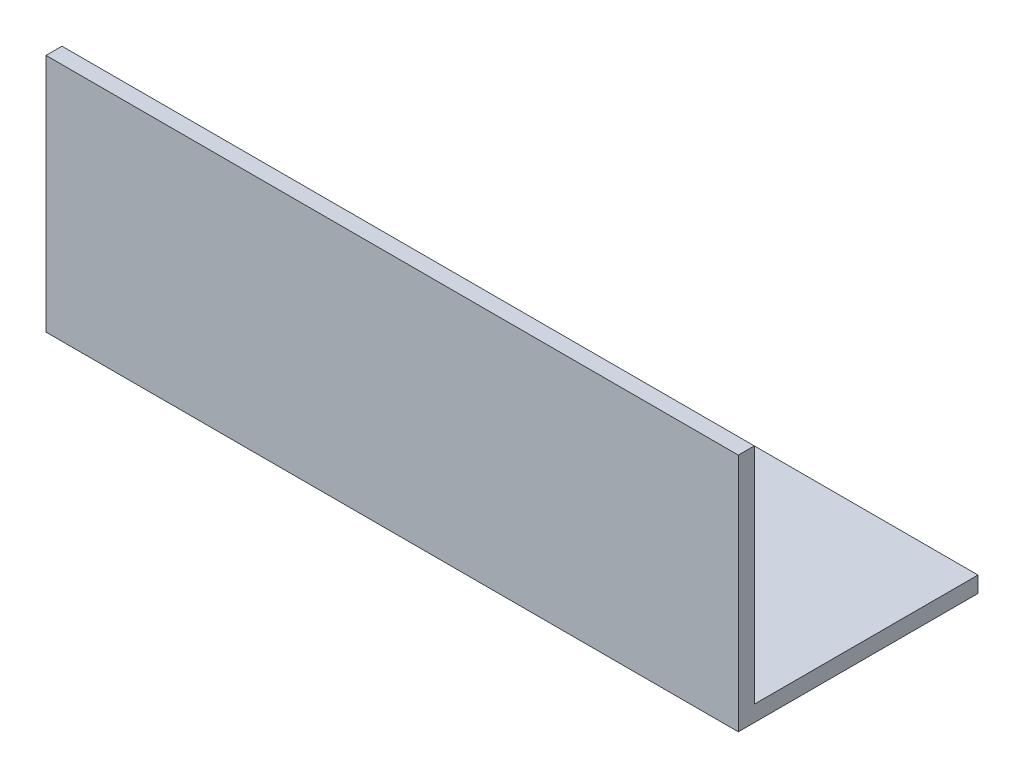
ISO-10303-21;
HEADER;
FILE_DESCRIPTION(('STEP AP214'),'2;1');
FILE_NAME('part.step','',(''),(''),'','','');
FILE_SCHEMA(('AUTOMOTIVE_DESIGN { 1 0 10303 214 1 1 1 1 }'));
ENDSEC;
DATA;
#1=APPLICATION_CONTEXT('core data for automotive mechanical design processes');
#2=APPLICATION_PROTOCOL_DEFINITION('international standard','automotive_design',2000,#1);
#3=PRODUCT_CONTEXT('',#1,'mechanical');
#4=PRODUCT('Part','Part','',(#3));
#5=PRODUCT_RELATED_PRODUCT_CATEGORY('part','',(#4));
#6=PRODUCT_DEFINITION_FORMATION('','',#4);
#7=PRODUCT_DEFINITION_CONTEXT('part definition',#1,'design');
#8=PRODUCT_DEFINITION('design','',#6,#7);
#9=PRODUCT_DEFINITION_SHAPE('','',#8);
#10=(LENGTH_UNIT() NAMED_UNIT(*) SI_UNIT(.MILLI.,.METRE.));
#11=(NAMED_UNIT(*) PLANE_ANGLE_UNIT() SI_UNIT($,.RADIAN.));
#12=(NAMED_UNIT(*) SI_UNIT($,.STERADIAN.) SOLID_ANGLE_UNIT());
#13=UNCERTAINTY_MEASURE_WITH_UNIT(LENGTH_MEASURE(1.E-05),#10,'distance_accuracy_value','');
#14=(GEOMETRIC_REPRESENTATION_CONTEXT(3) GLOBAL_UNCERTAINTY_ASSIGNED_CONTEXT((#13)) GLOBAL_UNIT_ASSIGNED_CONTEXT((#10,
#11,#12)) REPRESENTATION_CONTEXT('',''));
#15=CARTESIAN_POINT('',(0.,0.,0.));
#16=DIRECTION('',(0.,0.,1.));
#17=DIRECTION('',(1.,0.,0.));
#18=AXIS2_PLACEMENT_3D('',#15,#16,#17);
#19=CARTESIAN_POINT('',(130.,0.,0.));
#20=DIRECTION('',(0.,1.,0.));
#21=DIRECTION('',(0.,0.,1.));
#22=AXIS2_PLACEMENT_3D('',#19,#20,#21);
#23=PLANE('',#22);
#24=DIRECTION('',(0.,0.,-1.));
#25=VECTOR('',#24,1.);
#26=CARTESIAN_POINT('',(0.,0.,0.));
#27=LINE('',#26,#25);
#28=CARTESIAN_POINT('',(0.,0.,0.));
#29=VERTEX_POINT('',#28);
#30=CARTESIAN_POINT('',(0.,0.,-45.));
#31=VERTEX_POINT('',#30);
#32=EDGE_CURVE('E116',#29,#31,#27,.T.);
#33=ORIENTED_EDGE('',*,*,#32,.T.);
#34=DIRECTION('',(-1.,0.,0.));
#35=VECTOR('',#34,1.);
#36=CARTESIAN_POINT('',(130.,0.,-45.));
#37=LINE('',#36,#35);
#38=CARTESIAN_POINT('',(130.,0.,-45.));
#39=VERTEX_POINT('',#38);
#40=EDGE_CURVE('E11',#39,#31,#37,.T.);
#41=ORIENTED_EDGE('',*,*,#40,.F.);
#42=DIRECTION('',(0.,0.,-1.));
#43=VECTOR('',#42,1.);
#44=CARTESIAN_POINT('',(130.,0.,0.));
#45=LINE('',#44,#43);
#46=CARTESIAN_POINT('',(130.,0.,0.));
#47=VERTEX_POINT('',#46);
#48=EDGE_CURVE('E81',#47,#39,#45,.T.);
#49=ORIENTED_EDGE('',*,*,#48,.F.);
#50=DIRECTION('',(-1.,0.,0.));
#51=VECTOR('',#50,1.);
#52=CARTESIAN_POINT('',(130.,0.,0.));
#53=LINE('',#52,#51);
#54=EDGE_CURVE('E112',#47,#29,#53,.T.);
#55=ORIENTED_EDGE('',*,*,#54,.T.);
#56=EDGE_LOOP('',(#33,#41,#49,#55));
#57=FACE_BOUND('',#56,.T.);
#58=ADVANCED_FACE('F35',(#57),#23,.F.);
#59=CARTESIAN_POINT('',(130.,3.,-45.));
#60=DIRECTION('',(0.,0.,-1.));
#61=DIRECTION('',(-1.,0.,0.));
#62=AXIS2_PLACEMENT_3D('',#59,#60,#61);
#63=PLANE('',#62);
#64=DIRECTION('',(0.,-1.,0.));
#65=VECTOR('',#64,1.);
#66=CARTESIAN_POINT('',(0.,3.,-45.));
#67=LINE('',#66,#65);
#68=CARTESIAN_POINT('',(0.,3.,-45.));
#69=VERTEX_POINT('',#68);
#70=EDGE_CURVE('E119',#69,#31,#67,.T.);
#71=ORIENTED_EDGE('',*,*,#70,.F.);
#72=DIRECTION('',(-1.,0.,0.));
#73=VECTOR('',#72,1.);
#74=CARTESIAN_POINT('',(130.,3.,-45.));
#75=LINE('',#74,#73);
#76=CARTESIAN_POINT('',(130.,3.,-45.));
#77=VERTEX_POINT('',#76);
#78=EDGE_CURVE('E43',#77,#69,#75,.T.);
#79=ORIENTED_EDGE('',*,*,#78,.F.);
#80=DIRECTION('',(0.,-1.,0.));
#81=VECTOR('',#80,1.);
#82=CARTESIAN_POINT('',(130.,3.,-45.));
#83=LINE('',#82,#81);
#84=EDGE_CURVE('E205',#77,#39,#83,.T.);
#85=ORIENTED_EDGE('',*,*,#84,.T.);
#86=ORIENTED_EDGE('',*,*,#40,.T.);
#87=EDGE_LOOP('',(#71,#79,#85,#86));
#88=FACE_BOUND('',#87,.T.);
#89=ADVANCED_FACE('F137',(#88),#63,.T.);
#90=CARTESIAN_POINT('',(130.,3.,0.));
#91=DIRECTION('',(0.,1.,0.));
#92=DIRECTION('',(0.,0.,1.));
#93=AXIS2_PLACEMENT_3D('',#90,#91,#92);
#94=PLANE('',#93);
#95=DIRECTION('',(0.,0.,-1.));
#96=VECTOR('',#95,1.);
#97=CARTESIAN_POINT('',(0.,3.,0.));
#98=LINE('',#97,#96);
#99=CARTESIAN_POINT('',(0.,3.,-3.));
#100=VERTEX_POINT('',#99);
#101=EDGE_CURVE('E122',#100,#69,#98,.T.);
#102=ORIENTED_EDGE('',*,*,#101,.F.);
#103=DIRECTION('',(-1.,0.,0.));
#104=VECTOR('',#103,1.);
#105=CARTESIAN_POINT('',(130.,3.,-3.));
#106=LINE('',#105,#104);
#107=CARTESIAN_POINT('',(130.,3.,-3.));
#108=VERTEX_POINT('',#107);
#109=EDGE_CURVE('E102',#108,#100,#106,.T.);
#110=ORIENTED_EDGE('',*,*,#109,.F.);
#111=DIRECTION('',(0.,0.,-1.));
#112=VECTOR('',#111,1.);
#113=CARTESIAN_POINT('',(130.,3.,0.));
#114=LINE('',#113,#112);
#115=EDGE_CURVE('E108',#108,#77,#114,.T.);
#116=ORIENTED_EDGE('',*,*,#115,.T.);
#117=ORIENTED_EDGE('',*,*,#78,.T.);
#118=EDGE_LOOP('',(#102,#110,#116,#117));
#119=FACE_BOUND('',#118,.T.);
#120=ADVANCED_FACE('F134',(#119),#94,.T.);
#121=CARTESIAN_POINT('',(130.,0.,-3.));
#122=DIRECTION('',(0.,0.,-1.));
#123=DIRECTION('',(-1.,0.,0.));
#124=AXIS2_PLACEMENT_3D('',#121,#122,#123);
#125=PLANE('',#124);
#126=DIRECTION('',(0.,1.,0.));
#127=VECTOR('',#126,1.);
#128=CARTESIAN_POINT('',(0.,0.,-3.));
#129=LINE('',#128,#127);
#130=CARTESIAN_POINT('',(0.,45.,-3.));
#131=VERTEX_POINT('',#130);
#132=EDGE_CURVE('E97',#131,#100,#129,.F.);
#133=ORIENTED_EDGE('',*,*,#132,.F.);
#134=DIRECTION('',(-1.,0.,0.));
#135=VECTOR('',#134,1.);
#136=CARTESIAN_POINT('',(130.,45.,-3.));
#137=LINE('',#136,#135);
#138=CARTESIAN_POINT('',(130.,45.,-3.));
#139=VERTEX_POINT('',#138);
#140=EDGE_CURVE('E92',#139,#131,#137,.T.);
#141=ORIENTED_EDGE('',*,*,#140,.F.);
#142=DIRECTION('',(0.,1.,0.));
#143=VECTOR('',#142,1.);
#144=CARTESIAN_POINT('',(130.,0.,-3.));
#145=LINE('',#144,#143);
#146=EDGE_CURVE('E95',#139,#108,#145,.F.);
#147=ORIENTED_EDGE('',*,*,#146,.T.);
#148=ORIENTED_EDGE('',*,*,#109,.T.);
#149=EDGE_LOOP('',(#133,#141,#147,#148));
#150=FACE_BOUND('',#149,.T.);
#151=ADVANCED_FACE('F94',(#150),#125,.T.);
#152=CARTESIAN_POINT('',(130.,45.,0.));
#153=DIRECTION('',(0.,1.,0.));
#154=DIRECTION('',(0.,0.,1.));
#155=AXIS2_PLACEMENT_3D('',#152,#153,#154);
#156=PLANE('',#155);
#157=DIRECTION('',(0.,0.,-1.));
#158=VECTOR('',#157,1.);
#159=CARTESIAN_POINT('',(0.,45.,0.));
#160=LINE('',#159,#158);
#161=CARTESIAN_POINT('',(0.,45.,0.));
#162=VERTEX_POINT('',#161);
#163=EDGE_CURVE('E126',#162,#131,#160,.T.);
#164=ORIENTED_EDGE('',*,*,#163,.F.);
#165=DIRECTION('',(-1.,0.,0.));
#166=VECTOR('',#165,1.);
#167=CARTESIAN_POINT('',(130.,45.,0.));
#168=LINE('',#167,#166);
#169=CARTESIAN_POINT('',(130.,45.,0.));
#170=VERTEX_POINT('',#169);
#171=EDGE_CURVE('E72',#170,#162,#168,.T.);
#172=ORIENTED_EDGE('',*,*,#171,.F.);
#173=DIRECTION('',(0.,0.,-1.));
#174=VECTOR('',#173,1.);
#175=CARTESIAN_POINT('',(130.,45.,0.));
#176=LINE('',#175,#174);
#177=EDGE_CURVE('E106',#170,#139,#176,.T.);
#178=ORIENTED_EDGE('',*,*,#177,.T.);
#179=ORIENTED_EDGE('',*,*,#140,.T.);
#180=EDGE_LOOP('',(#164,#172,#178,#179));
#181=FACE_BOUND('',#180,.T.);
#182=ADVANCED_FACE('F110',(#181),#156,.T.);
#183=CARTESIAN_POINT('',(130.,0.,0.));
#184=DIRECTION('',(0.,0.,-1.));
#185=DIRECTION('',(-1.,0.,0.));
#186=AXIS2_PLACEMENT_3D('',#183,#184,#185);
#187=PLANE('',#186);
#188=DIRECTION('',(0.,-1.,0.));
#189=VECTOR('',#188,1.);
#190=CARTESIAN_POINT('',(0.,0.,0.));
#191=LINE('',#190,#189);
#192=EDGE_CURVE('E75',#162,#29,#191,.T.);
#193=ORIENTED_EDGE('',*,*,#192,.T.);
#194=ORIENTED_EDGE('',*,*,#54,.F.);
#195=DIRECTION('',(0.,-1.,0.));
#196=VECTOR('',#195,1.);
#197=CARTESIAN_POINT('',(130.,0.,0.));
#198=LINE('',#197,#196);
#199=EDGE_CURVE('E51',#170,#47,#198,.T.);
#200=ORIENTED_EDGE('',*,*,#199,.F.);
#201=ORIENTED_EDGE('',*,*,#171,.T.);
#202=EDGE_LOOP('',(#193,#194,#200,#201));
#203=FACE_BOUND('',#202,.T.);
#204=ADVANCED_FACE('F142',(#203),#187,.F.);
#205=CARTESIAN_POINT('',(130.,0.,0.));
#206=DIRECTION('',(-1.,0.,0.));
#207=DIRECTION('',(0.,0.,1.));
#208=AXIS2_PLACEMENT_3D('',#205,#206,#207);
#209=PLANE('',#208);
#210=ORIENTED_EDGE('',*,*,#48,.T.);
#211=ORIENTED_EDGE('',*,*,#84,.F.);
#212=ORIENTED_EDGE('',*,*,#115,.F.);
#213=ORIENTED_EDGE('',*,*,#146,.F.);
#214=ORIENTED_EDGE('',*,*,#177,.F.);
#215=ORIENTED_EDGE('',*,*,#199,.T.);
#216=EDGE_LOOP('',(#210,#211,#212,#213,#214,#215));
#217=FACE_BOUND('',#216,.T.);
#218=ADVANCED_FACE('F105',(#217),#209,.F.);
#219=CARTESIAN_POINT('',(0.,0.,0.));
#220=DIRECTION('',(-1.,0.,0.));
#221=DIRECTION('',(0.,0.,1.));
#222=AXIS2_PLACEMENT_3D('',#219,#220,#221);
#223=PLANE('',#222);
#224=ORIENTED_EDGE('',*,*,#32,.F.);
#225=ORIENTED_EDGE('',*,*,#192,.F.);
#226=ORIENTED_EDGE('',*,*,#163,.T.);
#227=ORIENTED_EDGE('',*,*,#132,.T.);
#228=ORIENTED_EDGE('',*,*,#101,.T.);
#229=ORIENTED_EDGE('',*,*,#70,.T.);
#230=EDGE_LOOP('',(#224,#225,#226,#227,#228,#229));
#231=FACE_BOUND('',#230,.T.);
#232=ADVANCED_FACE('F140',(#231),#223,.T.);
#233=CLOSED_SHELL('',(#58,#89,#120,#151,#182,#204,#218,#232));
#234=MANIFOLD_SOLID_BREP('B2',#233);
#235=ADVANCED_BREP_SHAPE_REPRESENTATION('',(#18,#234),#14);
#236=SHAPE_DEFINITION_REPRESENTATION(#9,#235);
ENDSEC;
END-ISO-10303-21;
